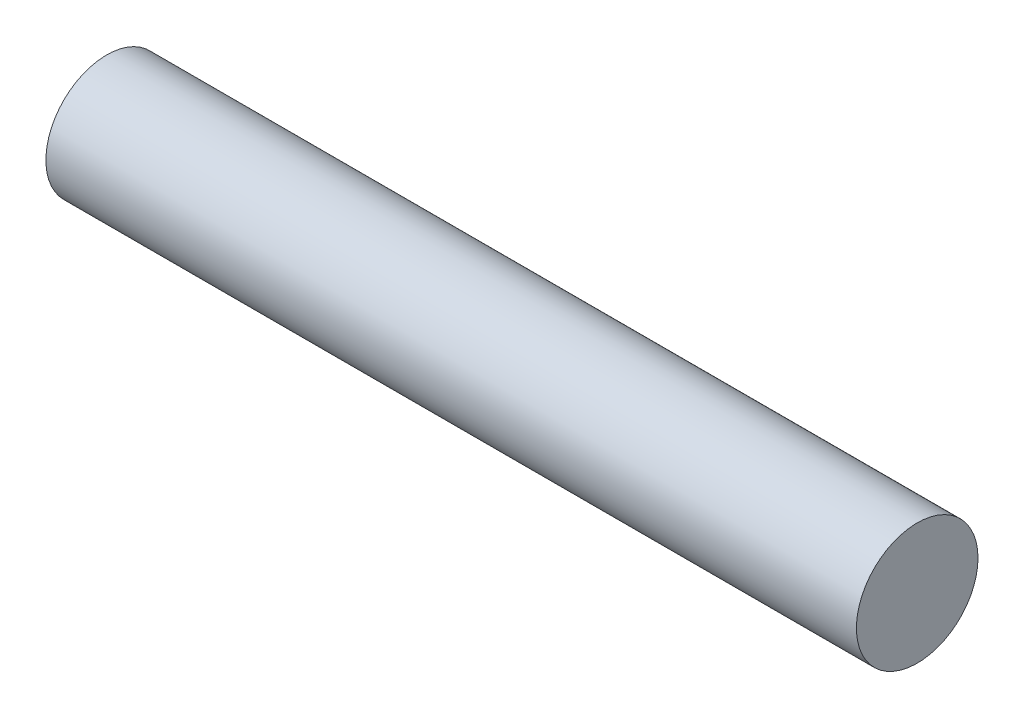
ISO-10303-21;
HEADER;
FILE_DESCRIPTION(('STEP AP214'),'2;1');
FILE_NAME('part.step','',(''),(''),'','','');
FILE_SCHEMA(('AUTOMOTIVE_DESIGN { 1 0 10303 214 1 1 1 1 }'));
ENDSEC;
DATA;
#1=APPLICATION_CONTEXT('core data for automotive mechanical design processes');
#2=APPLICATION_PROTOCOL_DEFINITION('international standard','automotive_design',2000,#1);
#3=PRODUCT_CONTEXT('',#1,'mechanical');
#4=PRODUCT('Part','Part','',(#3));
#5=PRODUCT_RELATED_PRODUCT_CATEGORY('part','',(#4));
#6=PRODUCT_DEFINITION_FORMATION('','',#4);
#7=PRODUCT_DEFINITION_CONTEXT('part definition',#1,'design');
#8=PRODUCT_DEFINITION('design','',#6,#7);
#9=PRODUCT_DEFINITION_SHAPE('','',#8);
#10=(LENGTH_UNIT() NAMED_UNIT(*) SI_UNIT(.MILLI.,.METRE.));
#11=(NAMED_UNIT(*) PLANE_ANGLE_UNIT() SI_UNIT($,.RADIAN.));
#12=(NAMED_UNIT(*) SI_UNIT($,.STERADIAN.) SOLID_ANGLE_UNIT());
#13=UNCERTAINTY_MEASURE_WITH_UNIT(LENGTH_MEASURE(1.E-05),#10,'distance_accuracy_value','');
#14=(GEOMETRIC_REPRESENTATION_CONTEXT(3) GLOBAL_UNCERTAINTY_ASSIGNED_CONTEXT((#13)) GLOBAL_UNIT_ASSIGNED_CONTEXT((#10,
#11,#12)) REPRESENTATION_CONTEXT('',''));
#15=CARTESIAN_POINT('',(0.,0.,0.));
#16=DIRECTION('',(0.,0.,1.));
#17=DIRECTION('',(1.,0.,0.));
#18=AXIS2_PLACEMENT_3D('',#15,#16,#17);
#19=CARTESIAN_POINT('',(30.,0.,0.));
#20=DIRECTION('',(-1.,0.,0.));
#21=DIRECTION('',(0.,0.,1.));
#22=AXIS2_PLACEMENT_3D('',#19,#20,#21);
#23=CYLINDRICAL_SURFACE('',#22,4.5);
#24=CARTESIAN_POINT('',(30.,0.,0.));
#25=DIRECTION('',(1.,0.,0.));
#26=DIRECTION('',(0.,0.,-1.));
#27=AXIS2_PLACEMENT_3D('',#24,#25,#26);
#28=CIRCLE('',#27,4.5);
#29=CARTESIAN_POINT('',(30.,0.,-4.5));
#30=VERTEX_POINT('',#29);
#31=EDGE_CURVE('E10',#30,#30,#28,.T.);
#32=ORIENTED_EDGE('',*,*,#31,.F.);
#33=EDGE_LOOP('',(#32));
#34=FACE_BOUND('',#33,.T.);
#35=CARTESIAN_POINT('',(-30.,0.,0.));
#36=DIRECTION('',(1.,0.,0.));
#37=DIRECTION('',(0.,0.,-1.));
#38=AXIS2_PLACEMENT_3D('',#35,#36,#37);
#39=CIRCLE('',#38,4.5);
#40=CARTESIAN_POINT('',(-30.,0.,-4.5));
#41=VERTEX_POINT('',#40);
#42=EDGE_CURVE('E35',#41,#41,#39,.T.);
#43=ORIENTED_EDGE('',*,*,#42,.T.);
#44=EDGE_LOOP('',(#43));
#45=FACE_BOUND('',#44,.T.);
#46=ADVANCED_FACE('F32',(#34,#45),#23,.T.);
#47=CARTESIAN_POINT('',(30.,0.,0.));
#48=DIRECTION('',(1.,0.,0.));
#49=DIRECTION('',(0.,0.,-1.));
#50=AXIS2_PLACEMENT_3D('',#47,#48,#49);
#51=PLANE('',#50);
#52=ORIENTED_EDGE('',*,*,#31,.T.);
#53=EDGE_LOOP('',(#52));
#54=FACE_BOUND('',#53,.T.);
#55=ADVANCED_FACE('F47',(#54),#51,.T.);
#56=CARTESIAN_POINT('',(-30.,0.,0.));
#57=DIRECTION('',(1.,0.,0.));
#58=DIRECTION('',(0.,0.,-1.));
#59=AXIS2_PLACEMENT_3D('',#56,#57,#58);
#60=PLANE('',#59);
#61=ORIENTED_EDGE('',*,*,#42,.F.);
#62=EDGE_LOOP('',(#61));
#63=FACE_BOUND('',#62,.T.);
#64=ADVANCED_FACE('F45',(#63),#60,.F.);
#65=CLOSED_SHELL('',(#46,#55,#64));
#66=MANIFOLD_SOLID_BREP('B2',#65);
#67=ADVANCED_BREP_SHAPE_REPRESENTATION('',(#18,#66),#14);
#68=SHAPE_DEFINITION_REPRESENTATION(#9,#67);
ENDSEC;
END-ISO-10303-21;
